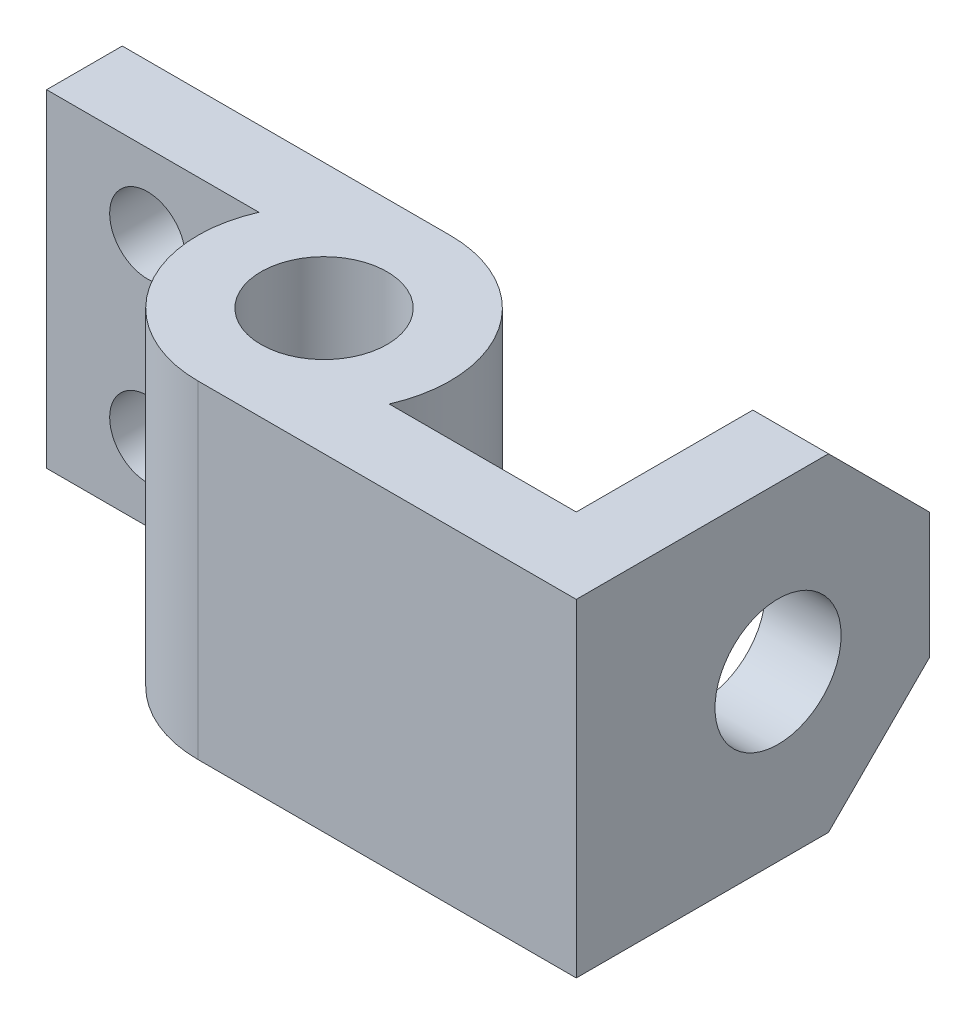
ISO-10303-21;
HEADER;
FILE_DESCRIPTION(('STEP AP214'),'2;1');
FILE_NAME('part.step','',(''),(''),'','','');
FILE_SCHEMA(('AUTOMOTIVE_DESIGN { 1 0 10303 214 1 1 1 1 }'));
ENDSEC;
DATA;
#1=APPLICATION_CONTEXT('core data for automotive mechanical design processes');
#2=APPLICATION_PROTOCOL_DEFINITION('international standard','automotive_design',2000,#1);
#3=PRODUCT_CONTEXT('',#1,'mechanical');
#4=PRODUCT('Part','Part','',(#3));
#5=PRODUCT_RELATED_PRODUCT_CATEGORY('part','',(#4));
#6=PRODUCT_DEFINITION_FORMATION('','',#4);
#7=PRODUCT_DEFINITION_CONTEXT('part definition',#1,'design');
#8=PRODUCT_DEFINITION('design','',#6,#7);
#9=PRODUCT_DEFINITION_SHAPE('','',#8);
#10=(LENGTH_UNIT() NAMED_UNIT(*) SI_UNIT(.MILLI.,.METRE.));
#11=(NAMED_UNIT(*) PLANE_ANGLE_UNIT() SI_UNIT($,.RADIAN.));
#12=(NAMED_UNIT(*) SI_UNIT($,.STERADIAN.) SOLID_ANGLE_UNIT());
#13=UNCERTAINTY_MEASURE_WITH_UNIT(LENGTH_MEASURE(1.E-05),#10,'distance_accuracy_value','');
#14=(GEOMETRIC_REPRESENTATION_CONTEXT(3) GLOBAL_UNCERTAINTY_ASSIGNED_CONTEXT((#13)) GLOBAL_UNIT_ASSIGNED_CONTEXT((#10,
#11,#12)) REPRESENTATION_CONTEXT('',''));
#15=CARTESIAN_POINT('',(0.,0.,0.));
#16=DIRECTION('',(0.,0.,1.));
#17=DIRECTION('',(1.,0.,0.));
#18=AXIS2_PLACEMENT_3D('',#15,#16,#17);
#19=CARTESIAN_POINT('',(0.,82.55,0.));
#20=DIRECTION('',(0.,1.,0.));
#21=DIRECTION('',(0.,0.,1.));
#22=AXIS2_PLACEMENT_3D('',#19,#20,#21);
#23=PLANE('',#22);
#24=DIRECTION('',(1.,0.,0.));
#25=VECTOR('',#24,1.);
#26=CARTESIAN_POINT('',(76.2,82.55,-31.75));
#27=LINE('',#26,#25);
#28=CARTESIAN_POINT('',(76.2,82.55,-31.75));
#29=VERTEX_POINT('',#28);
#30=CARTESIAN_POINT('',(95.25,82.55,-31.75));
#31=VERTEX_POINT('',#30);
#32=EDGE_CURVE('E317',#29,#31,#27,.T.);
#33=ORIENTED_EDGE('',*,*,#32,.F.);
#34=DIRECTION('',(0.,0.,1.));
#35=VECTOR('',#34,1.);
#36=CARTESIAN_POINT('',(76.2,82.55,-57.15));
#37=LINE('',#36,#35);
#38=CARTESIAN_POINT('',(76.2,82.55,12.7));
#39=VERTEX_POINT('',#38);
#40=EDGE_CURVE('E183',#29,#39,#37,.T.);
#41=ORIENTED_EDGE('',*,*,#40,.T.);
#42=DIRECTION('',(-1.,0.,0.));
#43=VECTOR('',#42,1.);
#44=CARTESIAN_POINT('',(76.2,82.55,12.7));
#45=LINE('',#44,#43);
#46=CARTESIAN_POINT('',(29.0993556629696,82.55,12.7));
#47=VERTEX_POINT('',#46);
#48=EDGE_CURVE('E185',#39,#47,#45,.T.);
#49=ORIENTED_EDGE('',*,*,#48,.T.);
#50=CARTESIAN_POINT('',(0.,82.55,0.));
#51=DIRECTION('',(0.,1.,0.));
#52=DIRECTION('',(0.,0.,1.));
#53=AXIS2_PLACEMENT_3D('',#50,#51,#52);
#54=CIRCLE('',#53,31.75);
#55=CARTESIAN_POINT('',(0.,82.55,-31.75));
#56=VERTEX_POINT('',#55);
#57=EDGE_CURVE('E187',#47,#56,#54,.T.);
#58=ORIENTED_EDGE('',*,*,#57,.T.);
#59=DIRECTION('',(-1.,0.,0.));
#60=VECTOR('',#59,1.);
#61=CARTESIAN_POINT('',(0.,82.55,-31.75));
#62=LINE('',#61,#60);
#63=CARTESIAN_POINT('',(-82.55,82.55,-31.75));
#64=VERTEX_POINT('',#63);
#65=EDGE_CURVE('E189',#56,#64,#62,.T.);
#66=ORIENTED_EDGE('',*,*,#65,.T.);
#67=DIRECTION('',(0.,0.,1.));
#68=VECTOR('',#67,1.);
#69=CARTESIAN_POINT('',(-82.55,82.55,-31.75));
#70=LINE('',#69,#68);
#71=CARTESIAN_POINT('',(-82.55,82.55,-12.7));
#72=VERTEX_POINT('',#71);
#73=EDGE_CURVE('E191',#64,#72,#70,.T.);
#74=ORIENTED_EDGE('',*,*,#73,.T.);
#75=DIRECTION('',(1.,0.,0.));
#76=VECTOR('',#75,1.);
#77=CARTESIAN_POINT('',(-82.55,82.55,-12.7));
#78=LINE('',#77,#76);
#79=CARTESIAN_POINT('',(-29.0993556629696,82.55,-12.7));
#80=VERTEX_POINT('',#79);
#81=EDGE_CURVE('E193',#72,#80,#78,.T.);
#82=ORIENTED_EDGE('',*,*,#81,.T.);
#83=CARTESIAN_POINT('',(0.,82.55,0.));
#84=DIRECTION('',(0.,1.,0.));
#85=DIRECTION('',(0.,0.,1.));
#86=AXIS2_PLACEMENT_3D('',#83,#84,#85);
#87=CIRCLE('',#86,31.75);
#88=CARTESIAN_POINT('',(3.32563597524808E-13,82.55,31.75));
#89=VERTEX_POINT('',#88);
#90=EDGE_CURVE('E174',#80,#89,#87,.T.);
#91=ORIENTED_EDGE('',*,*,#90,.T.);
#92=DIRECTION('',(1.,0.,0.));
#93=VECTOR('',#92,1.);
#94=CARTESIAN_POINT('',(3.32563597524808E-13,82.55,31.75));
#95=LINE('',#94,#93);
#96=CARTESIAN_POINT('',(95.25,82.55,31.75));
#97=VERTEX_POINT('',#96);
#98=EDGE_CURVE('E177',#89,#97,#95,.T.);
#99=ORIENTED_EDGE('',*,*,#98,.T.);
#100=DIRECTION('',(0.,0.,-1.));
#101=VECTOR('',#100,1.);
#102=CARTESIAN_POINT('',(95.25,82.55,31.75));
#103=LINE('',#102,#101);
#104=EDGE_CURVE('E180',#97,#31,#103,.T.);
#105=ORIENTED_EDGE('',*,*,#104,.T.);
#106=EDGE_LOOP('',(#33,#41,#49,#58,#66,#74,#82,#91,#99,#105));
#107=FACE_BOUND('',#106,.T.);
#108=CARTESIAN_POINT('',(0.,82.55,0.));
#109=DIRECTION('',(0.,1.,0.));
#110=DIRECTION('',(0.,0.,1.));
#111=AXIS2_PLACEMENT_3D('',#108,#109,#110);
#112=CIRCLE('',#111,15.875);
#113=CARTESIAN_POINT('',(0.,82.55,15.875));
#114=VERTEX_POINT('',#113);
#115=EDGE_CURVE('E168',#114,#114,#112,.T.);
#116=ORIENTED_EDGE('',*,*,#115,.F.);
#117=EDGE_LOOP('',(#116));
#118=FACE_BOUND('',#117,.T.);
#119=ADVANCED_FACE('F33',(#107,#118),#23,.T.);
#120=CARTESIAN_POINT('',(0.,0.,0.));
#121=DIRECTION('',(0.,1.,0.));
#122=DIRECTION('',(0.,0.,1.));
#123=AXIS2_PLACEMENT_3D('',#120,#121,#122);
#124=PLANE('',#123);
#125=DIRECTION('',(0.,0.,1.));
#126=VECTOR('',#125,1.);
#127=CARTESIAN_POINT('',(76.2,0.,-57.15));
#128=LINE('',#127,#126);
#129=CARTESIAN_POINT('',(76.2,0.,-31.75));
#130=VERTEX_POINT('',#129);
#131=CARTESIAN_POINT('',(76.2,0.,12.7));
#132=VERTEX_POINT('',#131);
#133=EDGE_CURVE('E203',#130,#132,#128,.T.);
#134=ORIENTED_EDGE('',*,*,#133,.F.);
#135=DIRECTION('',(1.,0.,0.));
#136=VECTOR('',#135,1.);
#137=CARTESIAN_POINT('',(76.2,0.,-31.75));
#138=LINE('',#137,#136);
#139=CARTESIAN_POINT('',(95.25,0.,-31.75));
#140=VERTEX_POINT('',#139);
#141=EDGE_CURVE('E58',#130,#140,#138,.T.);
#142=ORIENTED_EDGE('',*,*,#141,.T.);
#143=DIRECTION('',(0.,0.,-1.));
#144=VECTOR('',#143,1.);
#145=CARTESIAN_POINT('',(95.25,0.,31.75));
#146=LINE('',#145,#144);
#147=CARTESIAN_POINT('',(95.25,0.,31.75));
#148=VERTEX_POINT('',#147);
#149=EDGE_CURVE('E200',#148,#140,#146,.T.);
#150=ORIENTED_EDGE('',*,*,#149,.F.);
#151=DIRECTION('',(1.,0.,0.));
#152=VECTOR('',#151,1.);
#153=CARTESIAN_POINT('',(3.32563597524808E-13,0.,31.75));
#154=LINE('',#153,#152);
#155=CARTESIAN_POINT('',(3.32563597524808E-13,0.,31.75));
#156=VERTEX_POINT('',#155);
#157=EDGE_CURVE('E198',#156,#148,#154,.T.);
#158=ORIENTED_EDGE('',*,*,#157,.F.);
#159=CARTESIAN_POINT('',(0.,0.,0.));
#160=DIRECTION('',(0.,1.,0.));
#161=DIRECTION('',(0.,0.,1.));
#162=AXIS2_PLACEMENT_3D('',#159,#160,#161);
#163=CIRCLE('',#162,31.75);
#164=CARTESIAN_POINT('',(-29.0993556629696,0.,-12.7));
#165=VERTEX_POINT('',#164);
#166=EDGE_CURVE('E171',#165,#156,#163,.T.);
#167=ORIENTED_EDGE('',*,*,#166,.F.);
#168=DIRECTION('',(1.,0.,0.));
#169=VECTOR('',#168,1.);
#170=CARTESIAN_POINT('',(-82.55,0.,-12.7));
#171=LINE('',#170,#169);
#172=CARTESIAN_POINT('',(-82.55,0.,-12.7));
#173=VERTEX_POINT('',#172);
#174=EDGE_CURVE('E178',#173,#165,#171,.T.);
#175=ORIENTED_EDGE('',*,*,#174,.F.);
#176=DIRECTION('',(0.,0.,1.));
#177=VECTOR('',#176,1.);
#178=CARTESIAN_POINT('',(-82.55,0.,-31.75));
#179=LINE('',#178,#177);
#180=CARTESIAN_POINT('',(-82.55,0.,-31.75));
#181=VERTEX_POINT('',#180);
#182=EDGE_CURVE('E211',#181,#173,#179,.T.);
#183=ORIENTED_EDGE('',*,*,#182,.F.);
#184=DIRECTION('',(-1.,0.,0.));
#185=VECTOR('',#184,1.);
#186=CARTESIAN_POINT('',(0.,0.,-31.75));
#187=LINE('',#186,#185);
#188=CARTESIAN_POINT('',(0.,0.,-31.75));
#189=VERTEX_POINT('',#188);
#190=EDGE_CURVE('E209',#189,#181,#187,.T.);
#191=ORIENTED_EDGE('',*,*,#190,.F.);
#192=CARTESIAN_POINT('',(0.,0.,0.));
#193=DIRECTION('',(0.,1.,0.));
#194=DIRECTION('',(0.,0.,1.));
#195=AXIS2_PLACEMENT_3D('',#192,#193,#194);
#196=CIRCLE('',#195,31.75);
#197=CARTESIAN_POINT('',(29.0993556629696,0.,12.7));
#198=VERTEX_POINT('',#197);
#199=EDGE_CURVE('E207',#198,#189,#196,.T.);
#200=ORIENTED_EDGE('',*,*,#199,.F.);
#201=DIRECTION('',(-1.,0.,0.));
#202=VECTOR('',#201,1.);
#203=CARTESIAN_POINT('',(76.2,0.,12.7));
#204=LINE('',#203,#202);
#205=EDGE_CURVE('E205',#132,#198,#204,.T.);
#206=ORIENTED_EDGE('',*,*,#205,.F.);
#207=EDGE_LOOP('',(#134,#142,#150,#158,#167,#175,#183,#191,#200,#206));
#208=FACE_BOUND('',#207,.T.);
#209=CARTESIAN_POINT('',(0.,0.,0.));
#210=DIRECTION('',(0.,1.,0.));
#211=DIRECTION('',(0.,0.,1.));
#212=AXIS2_PLACEMENT_3D('',#209,#210,#211);
#213=CIRCLE('',#212,15.875);
#214=CARTESIAN_POINT('',(0.,0.,15.875));
#215=VERTEX_POINT('',#214);
#216=EDGE_CURVE('E158',#215,#215,#213,.T.);
#217=ORIENTED_EDGE('',*,*,#216,.T.);
#218=EDGE_LOOP('',(#217));
#219=FACE_BOUND('',#218,.T.);
#220=ADVANCED_FACE('F236',(#208,#219),#124,.F.);
#221=CARTESIAN_POINT('',(0.,82.55,0.));
#222=DIRECTION('',(0.,-1.,0.));
#223=DIRECTION('',(0.,0.,-1.));
#224=AXIS2_PLACEMENT_3D('',#221,#222,#223);
#225=CYLINDRICAL_SURFACE('',#224,31.75);
#226=ORIENTED_EDGE('',*,*,#166,.T.);
#227=DIRECTION('',(0.,-1.,0.));
#228=VECTOR('',#227,1.);
#229=CARTESIAN_POINT('',(3.32563597524808E-13,82.55,31.75));
#230=LINE('',#229,#228);
#231=EDGE_CURVE('E11',#89,#156,#230,.T.);
#232=ORIENTED_EDGE('',*,*,#231,.F.);
#233=ORIENTED_EDGE('',*,*,#90,.F.);
#234=DIRECTION('',(0.,-1.,0.));
#235=VECTOR('',#234,1.);
#236=CARTESIAN_POINT('',(-29.0993556629696,82.55,-12.7));
#237=LINE('',#236,#235);
#238=EDGE_CURVE('E195',#80,#165,#237,.T.);
#239=ORIENTED_EDGE('',*,*,#238,.T.);
#240=EDGE_LOOP('',(#226,#232,#233,#239));
#241=FACE_BOUND('',#240,.T.);
#242=ADVANCED_FACE('F35',(#241),#225,.T.);
#243=CARTESIAN_POINT('',(3.32563597524808E-13,82.55,31.75));
#244=DIRECTION('',(0.,0.,-1.));
#245=DIRECTION('',(-1.,0.,0.));
#246=AXIS2_PLACEMENT_3D('',#243,#244,#245);
#247=PLANE('',#246);
#248=ORIENTED_EDGE('',*,*,#157,.T.);
#249=DIRECTION('',(0.,-1.,0.));
#250=VECTOR('',#249,1.);
#251=CARTESIAN_POINT('',(95.25,82.55,31.75));
#252=LINE('',#251,#250);
#253=EDGE_CURVE('E42',#97,#148,#252,.T.);
#254=ORIENTED_EDGE('',*,*,#253,.F.);
#255=ORIENTED_EDGE('',*,*,#98,.F.);
#256=ORIENTED_EDGE('',*,*,#231,.T.);
#257=EDGE_LOOP('',(#248,#254,#255,#256));
#258=FACE_BOUND('',#257,.T.);
#259=ADVANCED_FACE('F263',(#258),#247,.F.);
#260=CARTESIAN_POINT('',(95.25,82.55,31.75));
#261=DIRECTION('',(-1.,0.,0.));
#262=DIRECTION('',(0.,0.,1.));
#263=AXIS2_PLACEMENT_3D('',#260,#261,#262);
#264=PLANE('',#263);
#265=CARTESIAN_POINT('',(95.25,41.402,-19.05));
#266=DIRECTION('',(1.,0.,0.));
#267=DIRECTION('',(0.,0.,-1.));
#268=AXIS2_PLACEMENT_3D('',#265,#266,#267);
#269=CIRCLE('',#268,15.875);
#270=CARTESIAN_POINT('',(95.25,41.402,-34.925));
#271=VERTEX_POINT('',#270);
#272=EDGE_CURVE('E311',#271,#271,#269,.T.);
#273=ORIENTED_EDGE('',*,*,#272,.F.);
#274=EDGE_LOOP('',(#273));
#275=FACE_BOUND('',#274,.T.);
#276=ORIENTED_EDGE('',*,*,#149,.T.);
#277=DIRECTION('',(0.,-0.707106781186547,0.707106781186547));
#278=VECTOR('',#277,1.);
#279=CARTESIAN_POINT('',(95.25,0.,-31.75));
#280=LINE('',#279,#278);
#281=CARTESIAN_POINT('',(95.25,25.4,-57.15));
#282=VERTEX_POINT('',#281);
#283=EDGE_CURVE('E129',#282,#140,#280,.T.);
#284=ORIENTED_EDGE('',*,*,#283,.F.);
#285=DIRECTION('',(0.,-1.,0.));
#286=VECTOR('',#285,1.);
#287=CARTESIAN_POINT('',(95.25,82.55,-57.15));
#288=LINE('',#287,#286);
#289=CARTESIAN_POINT('',(95.25,57.15,-57.15));
#290=VERTEX_POINT('',#289);
#291=EDGE_CURVE('E137',#290,#282,#288,.T.);
#292=ORIENTED_EDGE('',*,*,#291,.F.);
#293=DIRECTION('',(0.,-0.707106781186548,-0.707106781186547));
#294=VECTOR('',#293,1.);
#295=CARTESIAN_POINT('',(95.25,82.55,-31.75));
#296=LINE('',#295,#294);
#297=EDGE_CURVE('E314',#31,#290,#296,.T.);
#298=ORIENTED_EDGE('',*,*,#297,.F.);
#299=ORIENTED_EDGE('',*,*,#104,.F.);
#300=ORIENTED_EDGE('',*,*,#253,.T.);
#301=EDGE_LOOP('',(#276,#284,#292,#298,#299,#300));
#302=FACE_BOUND('',#301,.T.);
#303=ADVANCED_FACE('F258',(#275,#302),#264,.F.);
#304=CARTESIAN_POINT('',(95.25,82.55,-57.15));
#305=DIRECTION('',(0.,0.,1.));
#306=DIRECTION('',(1.,0.,0.));
#307=AXIS2_PLACEMENT_3D('',#304,#305,#306);
#308=PLANE('',#307);
#309=ORIENTED_EDGE('',*,*,#291,.T.);
#310=DIRECTION('',(1.,0.,0.));
#311=VECTOR('',#310,1.);
#312=CARTESIAN_POINT('',(76.2,25.4,-57.15));
#313=LINE('',#312,#311);
#314=CARTESIAN_POINT('',(76.2,25.4,-57.15));
#315=VERTEX_POINT('',#314);
#316=EDGE_CURVE('E124',#315,#282,#313,.T.);
#317=ORIENTED_EDGE('',*,*,#316,.F.);
#318=DIRECTION('',(0.,-1.,0.));
#319=VECTOR('',#318,1.);
#320=CARTESIAN_POINT('',(76.2,82.55,-57.15));
#321=LINE('',#320,#319);
#322=CARTESIAN_POINT('',(76.2,57.15,-57.15));
#323=VERTEX_POINT('',#322);
#324=EDGE_CURVE('E135',#323,#315,#321,.T.);
#325=ORIENTED_EDGE('',*,*,#324,.F.);
#326=DIRECTION('',(1.,0.,0.));
#327=VECTOR('',#326,1.);
#328=CARTESIAN_POINT('',(76.2,57.15,-57.15));
#329=LINE('',#328,#327);
#330=EDGE_CURVE('E50',#323,#290,#329,.T.);
#331=ORIENTED_EDGE('',*,*,#330,.T.);
#332=EDGE_LOOP('',(#309,#317,#325,#331));
#333=FACE_BOUND('',#332,.T.);
#334=ADVANCED_FACE('F134',(#333),#308,.F.);
#335=CARTESIAN_POINT('',(76.2,82.55,-57.15));
#336=DIRECTION('',(1.,0.,0.));
#337=DIRECTION('',(0.,0.,-1.));
#338=AXIS2_PLACEMENT_3D('',#335,#336,#337);
#339=PLANE('',#338);
#340=CARTESIAN_POINT('',(76.2,41.402,-19.05));
#341=DIRECTION('',(1.,0.,0.));
#342=DIRECTION('',(0.,0.,-1.));
#343=AXIS2_PLACEMENT_3D('',#340,#341,#342);
#344=CIRCLE('',#343,15.875);
#345=CARTESIAN_POINT('',(76.2,41.402,-34.925));
#346=VERTEX_POINT('',#345);
#347=EDGE_CURVE('E308',#346,#346,#344,.T.);
#348=ORIENTED_EDGE('',*,*,#347,.T.);
#349=EDGE_LOOP('',(#348));
#350=FACE_BOUND('',#349,.T.);
#351=ORIENTED_EDGE('',*,*,#324,.T.);
#352=DIRECTION('',(0.,-0.707106781186547,0.707106781186547));
#353=VECTOR('',#352,1.);
#354=CARTESIAN_POINT('',(76.2,0.,-31.75));
#355=LINE('',#354,#353);
#356=EDGE_CURVE('E121',#315,#130,#355,.T.);
#357=ORIENTED_EDGE('',*,*,#356,.T.);
#358=ORIENTED_EDGE('',*,*,#133,.T.);
#359=DIRECTION('',(0.,-1.,0.));
#360=VECTOR('',#359,1.);
#361=CARTESIAN_POINT('',(76.2,82.55,12.7));
#362=LINE('',#361,#360);
#363=EDGE_CURVE('E143',#39,#132,#362,.T.);
#364=ORIENTED_EDGE('',*,*,#363,.F.);
#365=ORIENTED_EDGE('',*,*,#40,.F.);
#366=DIRECTION('',(0.,-0.707106781186548,-0.707106781186547));
#367=VECTOR('',#366,1.);
#368=CARTESIAN_POINT('',(76.2,82.55,-31.75));
#369=LINE('',#368,#367);
#370=EDGE_CURVE('E142',#29,#323,#369,.T.);
#371=ORIENTED_EDGE('',*,*,#370,.T.);
#372=EDGE_LOOP('',(#351,#357,#358,#364,#365,#371));
#373=FACE_BOUND('',#372,.T.);
#374=ADVANCED_FACE('F140',(#350,#373),#339,.F.);
#375=CARTESIAN_POINT('',(76.2,82.55,12.7));
#376=DIRECTION('',(0.,0.,1.));
#377=DIRECTION('',(1.,0.,0.));
#378=AXIS2_PLACEMENT_3D('',#375,#376,#377);
#379=PLANE('',#378);
#380=ORIENTED_EDGE('',*,*,#205,.T.);
#381=DIRECTION('',(0.,-1.,0.));
#382=VECTOR('',#381,1.);
#383=CARTESIAN_POINT('',(29.0993556629696,82.55,12.7));
#384=LINE('',#383,#382);
#385=EDGE_CURVE('E147',#47,#198,#384,.T.);
#386=ORIENTED_EDGE('',*,*,#385,.F.);
#387=ORIENTED_EDGE('',*,*,#48,.F.);
#388=ORIENTED_EDGE('',*,*,#363,.T.);
#389=EDGE_LOOP('',(#380,#386,#387,#388));
#390=FACE_BOUND('',#389,.T.);
#391=ADVANCED_FACE('F254',(#390),#379,.F.);
#392=CARTESIAN_POINT('',(0.,82.55,0.));
#393=DIRECTION('',(0.,-1.,0.));
#394=DIRECTION('',(0.,0.,-1.));
#395=AXIS2_PLACEMENT_3D('',#392,#393,#394);
#396=CYLINDRICAL_SURFACE('',#395,31.75);
#397=ORIENTED_EDGE('',*,*,#199,.T.);
#398=DIRECTION('',(0.,-1.,0.));
#399=VECTOR('',#398,1.);
#400=CARTESIAN_POINT('',(0.,82.55,-31.75));
#401=LINE('',#400,#399);
#402=EDGE_CURVE('E222',#56,#189,#401,.T.);
#403=ORIENTED_EDGE('',*,*,#402,.F.);
#404=ORIENTED_EDGE('',*,*,#57,.F.);
#405=ORIENTED_EDGE('',*,*,#385,.T.);
#406=EDGE_LOOP('',(#397,#403,#404,#405));
#407=FACE_BOUND('',#406,.T.);
#408=ADVANCED_FACE('F229',(#407),#396,.T.);
#409=CARTESIAN_POINT('',(0.,82.55,-31.75));
#410=DIRECTION('',(0.,0.,1.));
#411=DIRECTION('',(1.,0.,0.));
#412=AXIS2_PLACEMENT_3D('',#409,#410,#411);
#413=PLANE('',#412);
#414=CARTESIAN_POINT('',(-57.15,63.5,-31.75));
#415=DIRECTION('',(0.,0.,-1.));
#416=DIRECTION('',(-1.,0.,0.));
#417=AXIS2_PLACEMENT_3D('',#414,#415,#416);
#418=CIRCLE('',#417,9.52500000000001);
#419=CARTESIAN_POINT('',(-66.675,63.5,-31.75));
#420=VERTEX_POINT('',#419);
#421=EDGE_CURVE('E154',#420,#420,#418,.T.);
#422=ORIENTED_EDGE('',*,*,#421,.F.);
#423=EDGE_LOOP('',(#422));
#424=FACE_BOUND('',#423,.T.);
#425=CARTESIAN_POINT('',(-57.15,19.05,-31.75));
#426=DIRECTION('',(0.,0.,-1.));
#427=DIRECTION('',(-1.,0.,0.));
#428=AXIS2_PLACEMENT_3D('',#425,#426,#427);
#429=CIRCLE('',#428,9.52500000000001);
#430=CARTESIAN_POINT('',(-66.675,19.05,-31.75));
#431=VERTEX_POINT('',#430);
#432=EDGE_CURVE('E138',#431,#431,#429,.T.);
#433=ORIENTED_EDGE('',*,*,#432,.F.);
#434=EDGE_LOOP('',(#433));
#435=FACE_BOUND('',#434,.T.);
#436=ORIENTED_EDGE('',*,*,#190,.T.);
#437=DIRECTION('',(0.,-1.,0.));
#438=VECTOR('',#437,1.);
#439=CARTESIAN_POINT('',(-82.55,82.55,-31.75));
#440=LINE('',#439,#438);
#441=EDGE_CURVE('E219',#64,#181,#440,.T.);
#442=ORIENTED_EDGE('',*,*,#441,.F.);
#443=ORIENTED_EDGE('',*,*,#65,.F.);
#444=ORIENTED_EDGE('',*,*,#402,.T.);
#445=EDGE_LOOP('',(#436,#442,#443,#444));
#446=FACE_BOUND('',#445,.T.);
#447=ADVANCED_FACE('F242',(#424,#435,#446),#413,.F.);
#448=CARTESIAN_POINT('',(-82.55,82.55,-31.75));
#449=DIRECTION('',(1.,0.,0.));
#450=DIRECTION('',(0.,0.,-1.));
#451=AXIS2_PLACEMENT_3D('',#448,#449,#450);
#452=PLANE('',#451);
#453=ORIENTED_EDGE('',*,*,#182,.T.);
#454=DIRECTION('',(0.,-1.,0.));
#455=VECTOR('',#454,1.);
#456=CARTESIAN_POINT('',(-82.55,82.55,-12.7));
#457=LINE('',#456,#455);
#458=EDGE_CURVE('E216',#72,#173,#457,.T.);
#459=ORIENTED_EDGE('',*,*,#458,.F.);
#460=ORIENTED_EDGE('',*,*,#73,.F.);
#461=ORIENTED_EDGE('',*,*,#441,.T.);
#462=EDGE_LOOP('',(#453,#459,#460,#461));
#463=FACE_BOUND('',#462,.T.);
#464=ADVANCED_FACE('F246',(#463),#452,.F.);
#465=CARTESIAN_POINT('',(-82.55,82.55,-12.7));
#466=DIRECTION('',(0.,0.,-1.));
#467=DIRECTION('',(-1.,0.,0.));
#468=AXIS2_PLACEMENT_3D('',#465,#466,#467);
#469=PLANE('',#468);
#470=CARTESIAN_POINT('',(-57.15,63.5,-12.7));
#471=DIRECTION('',(0.,0.,-1.));
#472=DIRECTION('',(-1.,0.,0.));
#473=AXIS2_PLACEMENT_3D('',#470,#471,#472);
#474=CIRCLE('',#473,9.52500000000001);
#475=CARTESIAN_POINT('',(-66.675,63.5,-12.7));
#476=VERTEX_POINT('',#475);
#477=EDGE_CURVE('E37',#476,#476,#474,.T.);
#478=ORIENTED_EDGE('',*,*,#477,.T.);
#479=EDGE_LOOP('',(#478));
#480=FACE_BOUND('',#479,.T.);
#481=CARTESIAN_POINT('',(-57.15,19.05,-12.7));
#482=DIRECTION('',(0.,0.,-1.));
#483=DIRECTION('',(-1.,0.,0.));
#484=AXIS2_PLACEMENT_3D('',#481,#482,#483);
#485=CIRCLE('',#484,9.52500000000001);
#486=CARTESIAN_POINT('',(-66.675,19.05,-12.7));
#487=VERTEX_POINT('',#486);
#488=EDGE_CURVE('E152',#487,#487,#485,.T.);
#489=ORIENTED_EDGE('',*,*,#488,.T.);
#490=EDGE_LOOP('',(#489));
#491=FACE_BOUND('',#490,.T.);
#492=ORIENTED_EDGE('',*,*,#174,.T.);
#493=ORIENTED_EDGE('',*,*,#238,.F.);
#494=ORIENTED_EDGE('',*,*,#81,.F.);
#495=ORIENTED_EDGE('',*,*,#458,.T.);
#496=EDGE_LOOP('',(#492,#493,#494,#495));
#497=FACE_BOUND('',#496,.T.);
#498=ADVANCED_FACE('F269',(#480,#491,#497),#469,.F.);
#499=CARTESIAN_POINT('',(0.,82.55,0.));
#500=DIRECTION('',(0.,-1.,0.));
#501=DIRECTION('',(0.,0.,-1.));
#502=AXIS2_PLACEMENT_3D('',#499,#500,#501);
#503=CYLINDRICAL_SURFACE('',#502,15.875);
#504=ORIENTED_EDGE('',*,*,#115,.T.);
#505=EDGE_LOOP('',(#504));
#506=FACE_BOUND('',#505,.T.);
#507=ORIENTED_EDGE('',*,*,#216,.F.);
#508=EDGE_LOOP('',(#507));
#509=FACE_BOUND('',#508,.T.);
#510=ADVANCED_FACE('F271',(#506,#509),#503,.F.);
#511=CARTESIAN_POINT('',(-57.15,19.05,31.75));
#512=DIRECTION('',(0.,0.,-1.));
#513=DIRECTION('',(-1.,0.,0.));
#514=AXIS2_PLACEMENT_3D('',#511,#512,#513);
#515=CYLINDRICAL_SURFACE('',#514,9.52500000000001);
#516=ORIENTED_EDGE('',*,*,#432,.T.);
#517=EDGE_LOOP('',(#516));
#518=FACE_BOUND('',#517,.T.);
#519=ORIENTED_EDGE('',*,*,#488,.F.);
#520=EDGE_LOOP('',(#519));
#521=FACE_BOUND('',#520,.T.);
#522=ADVANCED_FACE('F278',(#518,#521),#515,.F.);
#523=CARTESIAN_POINT('',(-57.15,63.5,31.75));
#524=DIRECTION('',(0.,0.,-1.));
#525=DIRECTION('',(-1.,0.,0.));
#526=AXIS2_PLACEMENT_3D('',#523,#524,#525);
#527=CYLINDRICAL_SURFACE('',#526,9.52500000000001);
#528=ORIENTED_EDGE('',*,*,#421,.T.);
#529=EDGE_LOOP('',(#528));
#530=FACE_BOUND('',#529,.T.);
#531=ORIENTED_EDGE('',*,*,#477,.F.);
#532=EDGE_LOOP('',(#531));
#533=FACE_BOUND('',#532,.T.);
#534=ADVANCED_FACE('F291',(#530,#533),#527,.F.);
#535=CARTESIAN_POINT('',(76.2,82.55,-31.75));
#536=DIRECTION('',(0.,-0.707106781186547,0.707106781186548));
#537=DIRECTION('',(0.,-0.707106781186548,-0.707106781186547));
#538=AXIS2_PLACEMENT_3D('',#535,#536,#537);
#539=PLANE('',#538);
#540=ORIENTED_EDGE('',*,*,#297,.T.);
#541=ORIENTED_EDGE('',*,*,#330,.F.);
#542=ORIENTED_EDGE('',*,*,#370,.F.);
#543=ORIENTED_EDGE('',*,*,#32,.T.);
#544=EDGE_LOOP('',(#540,#541,#542,#543));
#545=FACE_BOUND('',#544,.T.);
#546=ADVANCED_FACE('F295',(#545),#539,.F.);
#547=CARTESIAN_POINT('',(76.2,0.,-31.75));
#548=DIRECTION('',(0.,0.707106781186547,0.707106781186547));
#549=DIRECTION('',(0.,-0.707106781186548,0.707106781186548));
#550=AXIS2_PLACEMENT_3D('',#547,#548,#549);
#551=PLANE('',#550);
#552=ORIENTED_EDGE('',*,*,#283,.T.);
#553=ORIENTED_EDGE('',*,*,#141,.F.);
#554=ORIENTED_EDGE('',*,*,#356,.F.);
#555=ORIENTED_EDGE('',*,*,#316,.T.);
#556=EDGE_LOOP('',(#552,#553,#554,#555));
#557=FACE_BOUND('',#556,.T.);
#558=ADVANCED_FACE('F123',(#557),#551,.F.);
#559=CARTESIAN_POINT('',(76.2,41.402,-19.05));
#560=DIRECTION('',(1.,0.,0.));
#561=DIRECTION('',(0.,0.,-1.));
#562=AXIS2_PLACEMENT_3D('',#559,#560,#561);
#563=CYLINDRICAL_SURFACE('',#562,15.875);
#564=ORIENTED_EDGE('',*,*,#347,.F.);
#565=EDGE_LOOP('',(#564));
#566=FACE_BOUND('',#565,.T.);
#567=ORIENTED_EDGE('',*,*,#272,.T.);
#568=EDGE_LOOP('',(#567));
#569=FACE_BOUND('',#568,.T.);
#570=ADVANCED_FACE('F300',(#566,#569),#563,.F.);
#571=CLOSED_SHELL('',(#119,#220,#242,#259,#303,#334,#374,#391,#408,#447,#464,#498,#510,#522,
#534,#546,#558,#570));
#572=MANIFOLD_SOLID_BREP('B2',#571);
#573=ADVANCED_BREP_SHAPE_REPRESENTATION('',(#18,#572),#14);
#574=SHAPE_DEFINITION_REPRESENTATION(#9,#573);
ENDSEC;
END-ISO-10303-21;
